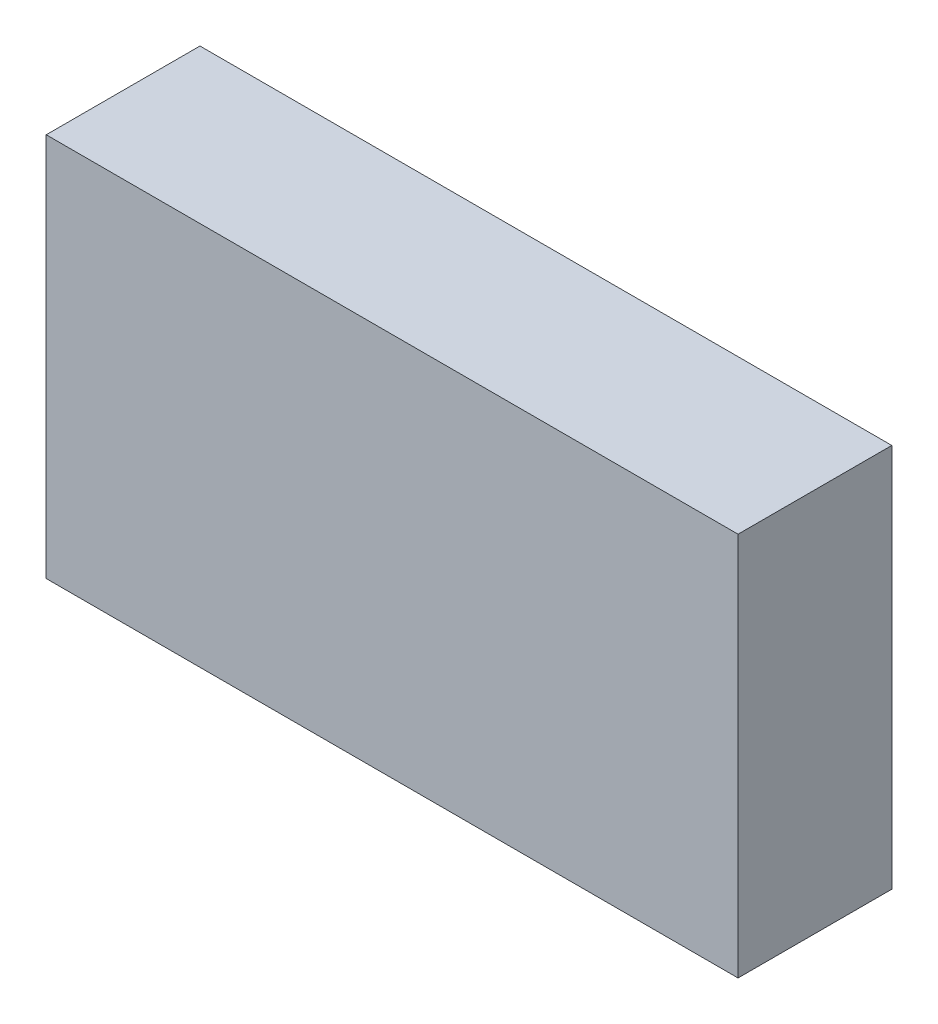
ISO-10303-21;
HEADER;
FILE_DESCRIPTION(('STEP AP214'),'2;1');
FILE_NAME('part.step','',(''),(''),'','','');
FILE_SCHEMA(('AUTOMOTIVE_DESIGN { 1 0 10303 214 1 1 1 1 }'));
ENDSEC;
DATA;
#1=APPLICATION_CONTEXT('core data for automotive mechanical design processes');
#2=APPLICATION_PROTOCOL_DEFINITION('international standard','automotive_design',2000,#1);
#3=PRODUCT_CONTEXT('',#1,'mechanical');
#4=PRODUCT('Part','Part','',(#3));
#5=PRODUCT_RELATED_PRODUCT_CATEGORY('part','',(#4));
#6=PRODUCT_DEFINITION_FORMATION('','',#4);
#7=PRODUCT_DEFINITION_CONTEXT('part definition',#1,'design');
#8=PRODUCT_DEFINITION('design','',#6,#7);
#9=PRODUCT_DEFINITION_SHAPE('','',#8);
#10=(LENGTH_UNIT() NAMED_UNIT(*) SI_UNIT(.MILLI.,.METRE.));
#11=(NAMED_UNIT(*) PLANE_ANGLE_UNIT() SI_UNIT($,.RADIAN.));
#12=(NAMED_UNIT(*) SI_UNIT($,.STERADIAN.) SOLID_ANGLE_UNIT());
#13=UNCERTAINTY_MEASURE_WITH_UNIT(LENGTH_MEASURE(1.E-05),#10,'distance_accuracy_value','');
#14=(GEOMETRIC_REPRESENTATION_CONTEXT(3) GLOBAL_UNCERTAINTY_ASSIGNED_CONTEXT((#13)) GLOBAL_UNIT_ASSIGNED_CONTEXT((#10,
#11,#12)) REPRESENTATION_CONTEXT('',''));
#15=CARTESIAN_POINT('',(0.,0.,0.));
#16=DIRECTION('',(0.,0.,1.));
#17=DIRECTION('',(1.,0.,0.));
#18=AXIS2_PLACEMENT_3D('',#15,#16,#17);
#19=CARTESIAN_POINT('',(-2.05,-0.625,0.));
#20=DIRECTION('',(1.,0.,0.));
#21=DIRECTION('',(0.,0.,1.));
#22=AXIS2_PLACEMENT_3D('',#19,#20,#21);
#23=PLANE('',#22);
#24=DIRECTION('',(0.,1.,0.));
#25=VECTOR('',#24,1.);
#26=CARTESIAN_POINT('',(-2.05,-0.625,0.1));
#27=LINE('',#26,#25);
#28=CARTESIAN_POINT('',(-2.05,-0.625,0.1));
#29=VERTEX_POINT('',#28);
#30=CARTESIAN_POINT('',(-2.05,-0.375,0.1));
#31=VERTEX_POINT('',#30);
#32=EDGE_CURVE('E11',#29,#31,#27,.T.);
#33=ORIENTED_EDGE('',*,*,#32,.T.);
#34=DIRECTION('',(0.,0.,1.));
#35=VECTOR('',#34,1.);
#36=CARTESIAN_POINT('',(-2.05,-0.375,0.));
#37=LINE('',#36,#35);
#38=CARTESIAN_POINT('',(-2.05,-0.375,0.));
#39=VERTEX_POINT('',#38);
#40=EDGE_CURVE('E24',#39,#31,#37,.T.);
#41=ORIENTED_EDGE('',*,*,#40,.F.);
#42=DIRECTION('',(0.,1.,0.));
#43=VECTOR('',#42,1.);
#44=CARTESIAN_POINT('',(-2.05,-0.625,0.));
#45=LINE('',#44,#43);
#46=CARTESIAN_POINT('',(-2.05,-0.625,0.));
#47=VERTEX_POINT('',#46);
#48=EDGE_CURVE('E86',#47,#39,#45,.T.);
#49=ORIENTED_EDGE('',*,*,#48,.F.);
#50=DIRECTION('',(0.,0.,1.));
#51=VECTOR('',#50,1.);
#52=CARTESIAN_POINT('',(-2.05,-0.625,0.));
#53=LINE('',#52,#51);
#54=EDGE_CURVE('E36',#47,#29,#53,.T.);
#55=ORIENTED_EDGE('',*,*,#54,.T.);
#56=EDGE_LOOP('',(#33,#41,#49,#55));
#57=FACE_BOUND('',#56,.T.);
#58=ADVANCED_FACE('F17',(#57),#23,.F.);
#59=CARTESIAN_POINT('',(-1.6,-0.625,0.));
#60=DIRECTION('',(1.,0.,0.));
#61=DIRECTION('',(0.,0.,1.));
#62=AXIS2_PLACEMENT_3D('',#59,#60,#61);
#63=PLANE('',#62);
#64=DIRECTION('',(0.,0.,1.));
#65=VECTOR('',#64,1.);
#66=CARTESIAN_POINT('',(-1.6,-0.625,0.));
#67=LINE('',#66,#65);
#68=CARTESIAN_POINT('',(-1.6,-0.625,0.));
#69=VERTEX_POINT('',#68);
#70=CARTESIAN_POINT('',(-1.6,-0.625,0.1));
#71=VERTEX_POINT('',#70);
#72=EDGE_CURVE('E83',#69,#71,#67,.T.);
#73=ORIENTED_EDGE('',*,*,#72,.F.);
#74=DIRECTION('',(0.,1.,0.));
#75=VECTOR('',#74,1.);
#76=CARTESIAN_POINT('',(-1.6,-0.625,0.));
#77=LINE('',#76,#75);
#78=CARTESIAN_POINT('',(-1.6,-0.375,0.));
#79=VERTEX_POINT('',#78);
#80=EDGE_CURVE('E63',#69,#79,#77,.T.);
#81=ORIENTED_EDGE('',*,*,#80,.T.);
#82=DIRECTION('',(0.,0.,1.));
#83=VECTOR('',#82,1.);
#84=CARTESIAN_POINT('',(-1.6,-0.375,0.));
#85=LINE('',#84,#83);
#86=CARTESIAN_POINT('',(-1.6,-0.375,0.1));
#87=VERTEX_POINT('',#86);
#88=EDGE_CURVE('E57',#79,#87,#85,.T.);
#89=ORIENTED_EDGE('',*,*,#88,.T.);
#90=DIRECTION('',(0.,1.,0.));
#91=VECTOR('',#90,1.);
#92=CARTESIAN_POINT('',(-1.6,-0.625,0.1));
#93=LINE('',#92,#91);
#94=EDGE_CURVE('E60',#71,#87,#93,.T.);
#95=ORIENTED_EDGE('',*,*,#94,.F.);
#96=EDGE_LOOP('',(#73,#81,#89,#95));
#97=FACE_BOUND('',#96,.T.);
#98=ADVANCED_FACE('F59',(#97),#63,.T.);
#99=CARTESIAN_POINT('',(-2.05,-0.625,0.));
#100=DIRECTION('',(0.,1.,0.));
#101=DIRECTION('',(0.,0.,1.));
#102=AXIS2_PLACEMENT_3D('',#99,#100,#101);
#103=PLANE('',#102);
#104=ORIENTED_EDGE('',*,*,#72,.T.);
#105=DIRECTION('',(1.,0.,0.));
#106=VECTOR('',#105,1.);
#107=CARTESIAN_POINT('',(-2.05,-0.625,0.1));
#108=LINE('',#107,#106);
#109=EDGE_CURVE('E71',#29,#71,#108,.T.);
#110=ORIENTED_EDGE('',*,*,#109,.F.);
#111=ORIENTED_EDGE('',*,*,#54,.F.);
#112=DIRECTION('',(1.,0.,0.));
#113=VECTOR('',#112,1.);
#114=CARTESIAN_POINT('',(-2.05,-0.625,0.));
#115=LINE('',#114,#113);
#116=EDGE_CURVE('E76',#47,#69,#115,.T.);
#117=ORIENTED_EDGE('',*,*,#116,.T.);
#118=EDGE_LOOP('',(#104,#110,#111,#117));
#119=FACE_BOUND('',#118,.T.);
#120=ADVANCED_FACE('F91',(#119),#103,.F.);
#121=CARTESIAN_POINT('',(-2.05,-0.375,0.));
#122=DIRECTION('',(0.,1.,0.));
#123=DIRECTION('',(0.,0.,1.));
#124=AXIS2_PLACEMENT_3D('',#121,#122,#123);
#125=PLANE('',#124);
#126=DIRECTION('',(1.,0.,0.));
#127=VECTOR('',#126,1.);
#128=CARTESIAN_POINT('',(-2.05,-0.375,0.));
#129=LINE('',#128,#127);
#130=EDGE_CURVE('E74',#39,#79,#129,.T.);
#131=ORIENTED_EDGE('',*,*,#130,.F.);
#132=ORIENTED_EDGE('',*,*,#40,.T.);
#133=DIRECTION('',(1.,0.,0.));
#134=VECTOR('',#133,1.);
#135=CARTESIAN_POINT('',(-2.05,-0.375,0.1));
#136=LINE('',#135,#134);
#137=EDGE_CURVE('E69',#31,#87,#136,.T.);
#138=ORIENTED_EDGE('',*,*,#137,.T.);
#139=ORIENTED_EDGE('',*,*,#88,.F.);
#140=EDGE_LOOP('',(#131,#132,#138,#139));
#141=FACE_BOUND('',#140,.T.);
#142=ADVANCED_FACE('F73',(#141),#125,.T.);
#143=CARTESIAN_POINT('',(-2.05,-0.625,0.));
#144=DIRECTION('',(0.,0.,1.));
#145=DIRECTION('',(1.,0.,0.));
#146=AXIS2_PLACEMENT_3D('',#143,#144,#145);
#147=PLANE('',#146);
#148=ORIENTED_EDGE('',*,*,#130,.T.);
#149=ORIENTED_EDGE('',*,*,#80,.F.);
#150=ORIENTED_EDGE('',*,*,#116,.F.);
#151=ORIENTED_EDGE('',*,*,#48,.T.);
#152=EDGE_LOOP('',(#148,#149,#150,#151));
#153=FACE_BOUND('',#152,.T.);
#154=ADVANCED_FACE('F89',(#153),#147,.F.);
#155=CARTESIAN_POINT('',(-2.05,-0.625,0.1));
#156=DIRECTION('',(0.,0.,1.));
#157=DIRECTION('',(1.,0.,0.));
#158=AXIS2_PLACEMENT_3D('',#155,#156,#157);
#159=PLANE('',#158);
#160=ORIENTED_EDGE('',*,*,#32,.F.);
#161=ORIENTED_EDGE('',*,*,#109,.T.);
#162=ORIENTED_EDGE('',*,*,#94,.T.);
#163=ORIENTED_EDGE('',*,*,#137,.F.);
#164=EDGE_LOOP('',(#160,#161,#162,#163));
#165=FACE_BOUND('',#164,.T.);
#166=ADVANCED_FACE('F68',(#165),#159,.T.);
#167=CLOSED_SHELL('',(#58,#98,#120,#142,#154,#166));
#168=MANIFOLD_SOLID_BREP('B1',#167);
#169=ADVANCED_BREP_SHAPE_REPRESENTATION('',(#18,#168),#14);
#170=SHAPE_DEFINITION_REPRESENTATION(#9,#169);
ENDSEC;
END-ISO-10303-21;
